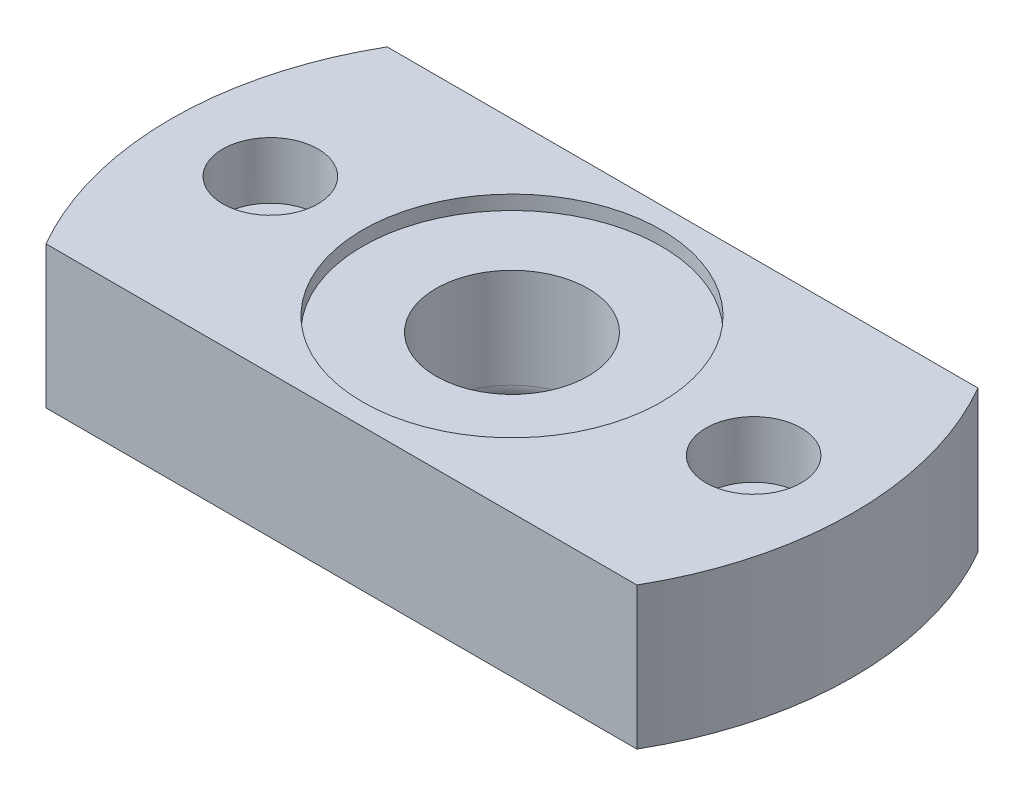
ISO-10303-21;
HEADER;
FILE_DESCRIPTION(('STEP AP214'),'2;1');
FILE_NAME('part.step','',(''),(''),'','','');
FILE_SCHEMA(('AUTOMOTIVE_DESIGN { 1 0 10303 214 1 1 1 1 }'));
ENDSEC;
DATA;
#1=APPLICATION_CONTEXT('core data for automotive mechanical design processes');
#2=APPLICATION_PROTOCOL_DEFINITION('international standard','automotive_design',2000,#1);
#3=PRODUCT_CONTEXT('',#1,'mechanical');
#4=PRODUCT('Part','Part','',(#3));
#5=PRODUCT_RELATED_PRODUCT_CATEGORY('part','',(#4));
#6=PRODUCT_DEFINITION_FORMATION('','',#4);
#7=PRODUCT_DEFINITION_CONTEXT('part definition',#1,'design');
#8=PRODUCT_DEFINITION('design','',#6,#7);
#9=PRODUCT_DEFINITION_SHAPE('','',#8);
#10=(LENGTH_UNIT() NAMED_UNIT(*) SI_UNIT(.MILLI.,.METRE.));
#11=(NAMED_UNIT(*) PLANE_ANGLE_UNIT() SI_UNIT($,.RADIAN.));
#12=(NAMED_UNIT(*) SI_UNIT($,.STERADIAN.) SOLID_ANGLE_UNIT());
#13=UNCERTAINTY_MEASURE_WITH_UNIT(LENGTH_MEASURE(1.E-05),#10,'distance_accuracy_value','');
#14=(GEOMETRIC_REPRESENTATION_CONTEXT(3) GLOBAL_UNCERTAINTY_ASSIGNED_CONTEXT((#13)) GLOBAL_UNIT_ASSIGNED_CONTEXT((#10,
#11,#12)) REPRESENTATION_CONTEXT('',''));
#15=CARTESIAN_POINT('',(0.,0.,0.));
#16=DIRECTION('',(0.,0.,1.));
#17=DIRECTION('',(1.,0.,0.));
#18=AXIS2_PLACEMENT_3D('',#15,#16,#17);
#19=CARTESIAN_POINT('',(-8.5,-1.,0.));
#20=DIRECTION('',(0.,1.,0.));
#21=DIRECTION('',(0.,0.,1.));
#22=AXIS2_PLACEMENT_3D('',#19,#20,#21);
#23=CYLINDRICAL_SURFACE('',#22,1.675);
#24=CARTESIAN_POINT('',(-8.5,5.,0.));
#25=DIRECTION('',(0.,1.,0.));
#26=DIRECTION('',(0.,0.,1.));
#27=AXIS2_PLACEMENT_3D('',#24,#25,#26);
#28=CIRCLE('',#27,1.675);
#29=CARTESIAN_POINT('',(-8.5,5.,1.675));
#30=VERTEX_POINT('',#29);
#31=EDGE_CURVE('E168',#30,#30,#28,.T.);
#32=ORIENTED_EDGE('',*,*,#31,.T.);
#33=EDGE_LOOP('',(#32));
#34=FACE_BOUND('',#33,.T.);
#35=CARTESIAN_POINT('',(-8.5,3.,0.));
#36=DIRECTION('',(0.,-1.,0.));
#37=DIRECTION('',(0.,0.,-1.));
#38=AXIS2_PLACEMENT_3D('',#35,#36,#37);
#39=CIRCLE('',#38,1.675);
#40=CARTESIAN_POINT('',(-8.5,3.,-1.675));
#41=VERTEX_POINT('',#40);
#42=EDGE_CURVE('E11',#41,#41,#39,.F.);
#43=ORIENTED_EDGE('',*,*,#42,.F.);
#44=EDGE_LOOP('',(#43));
#45=FACE_BOUND('',#44,.T.);
#46=ADVANCED_FACE('F31',(#34,#45),#23,.F.);
#47=CARTESIAN_POINT('',(8.5,-1.,0.));
#48=DIRECTION('',(0.,1.,0.));
#49=DIRECTION('',(0.,0.,1.));
#50=AXIS2_PLACEMENT_3D('',#47,#48,#49);
#51=CYLINDRICAL_SURFACE('',#50,1.675);
#52=CARTESIAN_POINT('',(8.5,5.,0.));
#53=DIRECTION('',(0.,1.,0.));
#54=DIRECTION('',(0.,0.,1.));
#55=AXIS2_PLACEMENT_3D('',#52,#53,#54);
#56=CIRCLE('',#55,1.675);
#57=CARTESIAN_POINT('',(8.5,5.,1.675));
#58=VERTEX_POINT('',#57);
#59=EDGE_CURVE('E320',#58,#58,#56,.T.);
#60=ORIENTED_EDGE('',*,*,#59,.T.);
#61=EDGE_LOOP('',(#60));
#62=FACE_BOUND('',#61,.T.);
#63=CARTESIAN_POINT('',(8.5,3.,0.));
#64=DIRECTION('',(0.,-1.,0.));
#65=DIRECTION('',(0.,0.,-1.));
#66=AXIS2_PLACEMENT_3D('',#63,#64,#65);
#67=CIRCLE('',#66,1.675);
#68=CARTESIAN_POINT('',(8.5,3.,-1.675));
#69=VERTEX_POINT('',#68);
#70=EDGE_CURVE('E39',#69,#69,#67,.F.);
#71=ORIENTED_EDGE('',*,*,#70,.F.);
#72=EDGE_LOOP('',(#71));
#73=FACE_BOUND('',#72,.T.);
#74=ADVANCED_FACE('F189',(#62,#73),#51,.F.);
#75=CARTESIAN_POINT('',(0.,5.,0.));
#76=DIRECTION('',(0.,-1.,0.));
#77=DIRECTION('',(0.,0.,-1.));
#78=AXIS2_PLACEMENT_3D('',#75,#76,#77);
#79=CYLINDRICAL_SURFACE('',#78,2.675);
#80=CARTESIAN_POINT('',(0.,1.,0.));
#81=DIRECTION('',(0.,1.,0.));
#82=DIRECTION('',(0.,0.,1.));
#83=AXIS2_PLACEMENT_3D('',#80,#81,#82);
#84=CIRCLE('',#83,2.675);
#85=CARTESIAN_POINT('',(0.,1.,2.675));
#86=VERTEX_POINT('',#85);
#87=EDGE_CURVE('E179',#86,#86,#84,.F.);
#88=ORIENTED_EDGE('',*,*,#87,.T.);
#89=EDGE_LOOP('',(#88));
#90=FACE_BOUND('',#89,.T.);
#91=CARTESIAN_POINT('',(0.,4.5,0.));
#92=DIRECTION('',(0.,1.,0.));
#93=DIRECTION('',(0.,0.,1.));
#94=AXIS2_PLACEMENT_3D('',#91,#92,#93);
#95=CIRCLE('',#94,2.675);
#96=CARTESIAN_POINT('',(0.,4.5,2.675));
#97=VERTEX_POINT('',#96);
#98=EDGE_CURVE('E161',#97,#97,#95,.T.);
#99=ORIENTED_EDGE('',*,*,#98,.T.);
#100=EDGE_LOOP('',(#99));
#101=FACE_BOUND('',#100,.T.);
#102=ADVANCED_FACE('F191',(#90,#101),#79,.F.);
#103=CARTESIAN_POINT('',(0.,5.,0.));
#104=DIRECTION('',(0.,-1.,0.));
#105=DIRECTION('',(0.,0.,-1.));
#106=AXIS2_PLACEMENT_3D('',#103,#104,#105);
#107=CYLINDRICAL_SURFACE('',#106,12.);
#108=CARTESIAN_POINT('',(0.,5.,0.));
#109=DIRECTION('',(0.,1.,0.));
#110=DIRECTION('',(0.,0.,1.));
#111=AXIS2_PLACEMENT_3D('',#108,#109,#110);
#112=CIRCLE('',#111,12.);
#113=CARTESIAN_POINT('',(-10.3923048454133,5.,-6.));
#114=VERTEX_POINT('',#113);
#115=CARTESIAN_POINT('',(-10.3923048454133,5.,6.));
#116=VERTEX_POINT('',#115);
#117=EDGE_CURVE('E53',#114,#116,#112,.T.);
#118=ORIENTED_EDGE('',*,*,#117,.F.);
#119=DIRECTION('',(0.,-1.,0.));
#120=VECTOR('',#119,1.);
#121=CARTESIAN_POINT('',(-10.3923048454133,5.,-6.));
#122=LINE('',#121,#120);
#123=CARTESIAN_POINT('',(-10.3923048454133,0.,-6.));
#124=VERTEX_POINT('',#123);
#125=EDGE_CURVE('E151',#114,#124,#122,.T.);
#126=ORIENTED_EDGE('',*,*,#125,.T.);
#127=CARTESIAN_POINT('',(0.,0.,0.));
#128=DIRECTION('',(0.,1.,0.));
#129=DIRECTION('',(0.,0.,1.));
#130=AXIS2_PLACEMENT_3D('',#127,#128,#129);
#131=CIRCLE('',#130,12.);
#132=CARTESIAN_POINT('',(-10.3923048454133,0.,6.));
#133=VERTEX_POINT('',#132);
#134=EDGE_CURVE('E160',#124,#133,#131,.T.);
#135=ORIENTED_EDGE('',*,*,#134,.T.);
#136=DIRECTION('',(0.,-1.,0.));
#137=VECTOR('',#136,1.);
#138=CARTESIAN_POINT('',(-10.3923048454133,5.,6.));
#139=LINE('',#138,#137);
#140=EDGE_CURVE('E171',#133,#116,#139,.F.);
#141=ORIENTED_EDGE('',*,*,#140,.T.);
#142=EDGE_LOOP('',(#118,#126,#135,#141));
#143=FACE_BOUND('',#142,.T.);
#144=ADVANCED_FACE('F198',(#143),#107,.T.);
#145=CARTESIAN_POINT('',(0.,5.,0.));
#146=DIRECTION('',(0.,1.,0.));
#147=DIRECTION('',(0.,0.,1.));
#148=AXIS2_PLACEMENT_3D('',#145,#146,#147);
#149=PLANE('',#148);
#150=CARTESIAN_POINT('',(0.,5.,0.));
#151=DIRECTION('',(0.,1.,0.));
#152=DIRECTION('',(0.,0.,1.));
#153=AXIS2_PLACEMENT_3D('',#150,#151,#152);
#154=CIRCLE('',#153,5.25);
#155=CARTESIAN_POINT('',(0.,5.,5.25));
#156=VERTEX_POINT('',#155);
#157=EDGE_CURVE('E607',#156,#156,#154,.T.);
#158=ORIENTED_EDGE('',*,*,#157,.F.);
#159=EDGE_LOOP('',(#158));
#160=FACE_BOUND('',#159,.T.);
#161=DIRECTION('',(1.,0.,0.));
#162=VECTOR('',#161,1.);
#163=CARTESIAN_POINT('',(0.,5.,-6.));
#164=LINE('',#163,#162);
#165=CARTESIAN_POINT('',(10.3923048454133,5.,-6.));
#166=VERTEX_POINT('',#165);
#167=EDGE_CURVE('E46',#114,#166,#164,.T.);
#168=ORIENTED_EDGE('',*,*,#167,.F.);
#169=ORIENTED_EDGE('',*,*,#117,.T.);
#170=DIRECTION('',(-1.,0.,0.));
#171=VECTOR('',#170,1.);
#172=CARTESIAN_POINT('',(0.,5.,6.));
#173=LINE('',#172,#171);
#174=CARTESIAN_POINT('',(10.3923048454133,5.,6.));
#175=VERTEX_POINT('',#174);
#176=EDGE_CURVE('E229',#175,#116,#173,.T.);
#177=ORIENTED_EDGE('',*,*,#176,.F.);
#178=EDGE_CURVE('E166',#175,#166,#112,.T.);
#179=ORIENTED_EDGE('',*,*,#178,.T.);
#180=EDGE_LOOP('',(#168,#169,#177,#179));
#181=FACE_BOUND('',#180,.T.);
#182=ORIENTED_EDGE('',*,*,#59,.F.);
#183=EDGE_LOOP('',(#182));
#184=FACE_BOUND('',#183,.T.);
#185=ORIENTED_EDGE('',*,*,#31,.F.);
#186=EDGE_LOOP('',(#185));
#187=FACE_BOUND('',#186,.T.);
#188=ADVANCED_FACE('F208',(#160,#181,#184,#187),#149,.T.);
#189=CARTESIAN_POINT('',(0.,0.,0.));
#190=DIRECTION('',(0.,1.,0.));
#191=DIRECTION('',(0.,0.,1.));
#192=AXIS2_PLACEMENT_3D('',#189,#190,#191);
#193=PLANE('',#192);
#194=CARTESIAN_POINT('',(0.,0.,0.));
#195=DIRECTION('',(0.,1.,0.));
#196=DIRECTION('',(0.,0.,1.));
#197=AXIS2_PLACEMENT_3D('',#194,#195,#196);
#198=CIRCLE('',#197,3.675);
#199=CARTESIAN_POINT('',(0.,0.,3.675));
#200=VERTEX_POINT('',#199);
#201=EDGE_CURVE('E176',#200,#200,#198,.T.);
#202=ORIENTED_EDGE('',*,*,#201,.T.);
#203=EDGE_LOOP('',(#202));
#204=FACE_BOUND('',#203,.T.);
#205=DIRECTION('',(-0.866025403784438,0.,-0.5));
#206=VECTOR('',#205,1.);
#207=CARTESIAN_POINT('',(5.575,0.,1.68874953737965));
#208=LINE('',#207,#206);
#209=CARTESIAN_POINT('',(8.5,0.,3.37749907475931));
#210=VERTEX_POINT('',#209);
#211=CARTESIAN_POINT('',(5.575,0.,1.68874953737965));
#212=VERTEX_POINT('',#211);
#213=EDGE_CURVE('E256',#210,#212,#208,.T.);
#214=ORIENTED_EDGE('',*,*,#213,.F.);
#215=DIRECTION('',(-0.866025403784439,0.,0.5));
#216=VECTOR('',#215,1.);
#217=CARTESIAN_POINT('',(8.5,0.,3.37749907475931));
#218=LINE('',#217,#216);
#219=CARTESIAN_POINT('',(11.425,0.,1.68874953737966));
#220=VERTEX_POINT('',#219);
#221=EDGE_CURVE('E231',#220,#210,#218,.T.);
#222=ORIENTED_EDGE('',*,*,#221,.F.);
#223=DIRECTION('',(0.,0.,1.));
#224=VECTOR('',#223,1.);
#225=CARTESIAN_POINT('',(11.425,0.,1.68874953737966));
#226=LINE('',#225,#224);
#227=CARTESIAN_POINT('',(11.425,0.,-1.68874953737966));
#228=VERTEX_POINT('',#227);
#229=EDGE_CURVE('E239',#228,#220,#226,.T.);
#230=ORIENTED_EDGE('',*,*,#229,.F.);
#231=DIRECTION('',(0.866025403784439,0.,0.5));
#232=VECTOR('',#231,1.);
#233=CARTESIAN_POINT('',(11.425,0.,-1.68874953737966));
#234=LINE('',#233,#232);
#235=CARTESIAN_POINT('',(8.5,0.,-3.37749907475931));
#236=VERTEX_POINT('',#235);
#237=EDGE_CURVE('E265',#236,#228,#234,.T.);
#238=ORIENTED_EDGE('',*,*,#237,.F.);
#239=DIRECTION('',(0.866025403784439,0.,-0.5));
#240=VECTOR('',#239,1.);
#241=CARTESIAN_POINT('',(8.5,0.,-3.37749907475931));
#242=LINE('',#241,#240);
#243=CARTESIAN_POINT('',(5.575,0.,-1.68874953737966));
#244=VERTEX_POINT('',#243);
#245=EDGE_CURVE('E262',#244,#236,#242,.T.);
#246=ORIENTED_EDGE('',*,*,#245,.F.);
#247=DIRECTION('',(0.,0.,-1.));
#248=VECTOR('',#247,1.);
#249=CARTESIAN_POINT('',(5.575,0.,-1.68874953737966));
#250=LINE('',#249,#248);
#251=EDGE_CURVE('E259',#212,#244,#250,.T.);
#252=ORIENTED_EDGE('',*,*,#251,.F.);
#253=EDGE_LOOP('',(#214,#222,#230,#238,#246,#252));
#254=FACE_BOUND('',#253,.T.);
#255=DIRECTION('',(0.866025403784439,0.,-0.5));
#256=VECTOR('',#255,1.);
#257=CARTESIAN_POINT('',(-11.425,0.,-1.68874953737966));
#258=LINE('',#257,#256);
#259=CARTESIAN_POINT('',(-11.425,0.,-1.68874953737965));
#260=VERTEX_POINT('',#259);
#261=CARTESIAN_POINT('',(-8.5,0.,-3.37749907475931));
#262=VERTEX_POINT('',#261);
#263=EDGE_CURVE('E304',#260,#262,#258,.T.);
#264=ORIENTED_EDGE('',*,*,#263,.F.);
#265=DIRECTION('',(0.,0.,-1.));
#266=VECTOR('',#265,1.);
#267=CARTESIAN_POINT('',(-11.425,0.,1.68874953737966));
#268=LINE('',#267,#266);
#269=CARTESIAN_POINT('',(-11.425,0.,1.68874953737966));
#270=VERTEX_POINT('',#269);
#271=EDGE_CURVE('E272',#270,#260,#268,.T.);
#272=ORIENTED_EDGE('',*,*,#271,.F.);
#273=DIRECTION('',(-0.866025403784439,0.,-0.5));
#274=VECTOR('',#273,1.);
#275=CARTESIAN_POINT('',(-8.5,0.,3.37749907475931));
#276=LINE('',#275,#274);
#277=CARTESIAN_POINT('',(-8.5,0.,3.37749907475931));
#278=VERTEX_POINT('',#277);
#279=EDGE_CURVE('E287',#278,#270,#276,.T.);
#280=ORIENTED_EDGE('',*,*,#279,.F.);
#281=DIRECTION('',(-0.866025403784438,0.,0.5));
#282=VECTOR('',#281,1.);
#283=CARTESIAN_POINT('',(-5.575,0.,1.68874953737965));
#284=LINE('',#283,#282);
#285=CARTESIAN_POINT('',(-5.575,0.,1.68874953737965));
#286=VERTEX_POINT('',#285);
#287=EDGE_CURVE('E313',#286,#278,#284,.T.);
#288=ORIENTED_EDGE('',*,*,#287,.F.);
#289=DIRECTION('',(0.,0.,1.));
#290=VECTOR('',#289,1.);
#291=CARTESIAN_POINT('',(-5.575,0.,-1.68874953737966));
#292=LINE('',#291,#290);
#293=CARTESIAN_POINT('',(-5.575,0.,-1.68874953737966));
#294=VERTEX_POINT('',#293);
#295=EDGE_CURVE('E310',#294,#286,#292,.T.);
#296=ORIENTED_EDGE('',*,*,#295,.F.);
#297=DIRECTION('',(0.866025403784439,0.,0.5));
#298=VECTOR('',#297,1.);
#299=CARTESIAN_POINT('',(-8.5,0.,-3.37749907475931));
#300=LINE('',#299,#298);
#301=EDGE_CURVE('E307',#262,#294,#300,.T.);
#302=ORIENTED_EDGE('',*,*,#301,.F.);
#303=EDGE_LOOP('',(#264,#272,#280,#288,#296,#302));
#304=FACE_BOUND('',#303,.T.);
#305=ORIENTED_EDGE('',*,*,#134,.F.);
#306=DIRECTION('',(-1.,0.,0.));
#307=VECTOR('',#306,1.);
#308=CARTESIAN_POINT('',(-10.3923048454133,0.,-6.));
#309=LINE('',#308,#307);
#310=CARTESIAN_POINT('',(10.3923048454133,0.,-6.));
#311=VERTEX_POINT('',#310);
#312=EDGE_CURVE('E145',#311,#124,#309,.T.);
#313=ORIENTED_EDGE('',*,*,#312,.F.);
#314=CARTESIAN_POINT('',(10.3923048454133,0.,6.));
#315=VERTEX_POINT('',#314);
#316=EDGE_CURVE('E159',#315,#311,#131,.T.);
#317=ORIENTED_EDGE('',*,*,#316,.F.);
#318=DIRECTION('',(1.,0.,0.));
#319=VECTOR('',#318,1.);
#320=CARTESIAN_POINT('',(-10.3923048454133,0.,6.));
#321=LINE('',#320,#319);
#322=EDGE_CURVE('E228',#133,#315,#321,.T.);
#323=ORIENTED_EDGE('',*,*,#322,.F.);
#324=EDGE_LOOP('',(#305,#313,#317,#323));
#325=FACE_BOUND('',#324,.T.);
#326=ADVANCED_FACE('F157',(#204,#254,#304,#325),#193,.F.);
#327=ORIENTED_EDGE('',*,*,#316,.T.);
#328=DIRECTION('',(0.,-1.,0.));
#329=VECTOR('',#328,1.);
#330=CARTESIAN_POINT('',(10.3923048454133,5.,-6.));
#331=LINE('',#330,#329);
#332=EDGE_CURVE('E142',#311,#166,#331,.F.);
#333=ORIENTED_EDGE('',*,*,#332,.T.);
#334=ORIENTED_EDGE('',*,*,#178,.F.);
#335=DIRECTION('',(0.,-1.,0.));
#336=VECTOR('',#335,1.);
#337=CARTESIAN_POINT('',(10.3923048454133,5.,6.));
#338=LINE('',#337,#336);
#339=EDGE_CURVE('E152',#175,#315,#338,.T.);
#340=ORIENTED_EDGE('',*,*,#339,.T.);
#341=EDGE_LOOP('',(#327,#333,#334,#340));
#342=FACE_BOUND('',#341,.T.);
#343=ADVANCED_FACE('F164',(#342),#107,.T.);
#344=CARTESIAN_POINT('',(-11.425,2.5,-1.68874953737966));
#345=DIRECTION('',(0.,-1.,0.));
#346=DIRECTION('',(0.,0.,-1.));
#347=AXIS2_PLACEMENT_3D('',#344,#345,#346);
#348=PLANE('',#347);
#349=DIRECTION('',(0.,0.,-1.));
#350=VECTOR('',#349,1.);
#351=CARTESIAN_POINT('',(-11.425,2.5,1.68874953737966));
#352=LINE('',#351,#350);
#353=CARTESIAN_POINT('',(-11.425,2.5,1.68874953737966));
#354=VERTEX_POINT('',#353);
#355=CARTESIAN_POINT('',(-11.425,2.5,-1.68874953737966));
#356=VERTEX_POINT('',#355);
#357=EDGE_CURVE('E283',#354,#356,#352,.T.);
#358=ORIENTED_EDGE('',*,*,#357,.T.);
#359=DIRECTION('',(0.866025403784439,0.,-0.5));
#360=VECTOR('',#359,1.);
#361=CARTESIAN_POINT('',(-11.425,2.5,-1.68874953737966));
#362=LINE('',#361,#360);
#363=CARTESIAN_POINT('',(-8.5,2.5,-3.37749907475931));
#364=VERTEX_POINT('',#363);
#365=EDGE_CURVE('E286',#356,#364,#362,.T.);
#366=ORIENTED_EDGE('',*,*,#365,.T.);
#367=DIRECTION('',(0.866025403784439,0.,0.5));
#368=VECTOR('',#367,1.);
#369=CARTESIAN_POINT('',(-8.5,2.5,-3.37749907475931));
#370=LINE('',#369,#368);
#371=CARTESIAN_POINT('',(-5.575,2.5,-1.68874953737966));
#372=VERTEX_POINT('',#371);
#373=EDGE_CURVE('E290',#364,#372,#370,.T.);
#374=ORIENTED_EDGE('',*,*,#373,.T.);
#375=DIRECTION('',(0.,0.,1.));
#376=VECTOR('',#375,1.);
#377=CARTESIAN_POINT('',(-5.575,2.5,-1.68874953737966));
#378=LINE('',#377,#376);
#379=CARTESIAN_POINT('',(-5.575,2.5,1.68874953737965));
#380=VERTEX_POINT('',#379);
#381=EDGE_CURVE('E293',#372,#380,#378,.T.);
#382=ORIENTED_EDGE('',*,*,#381,.T.);
#383=DIRECTION('',(-0.866025403784438,0.,0.5));
#384=VECTOR('',#383,1.);
#385=CARTESIAN_POINT('',(-5.575,2.5,1.68874953737965));
#386=LINE('',#385,#384);
#387=CARTESIAN_POINT('',(-8.5,2.5,3.37749907475931));
#388=VERTEX_POINT('',#387);
#389=EDGE_CURVE('E296',#380,#388,#386,.T.);
#390=ORIENTED_EDGE('',*,*,#389,.T.);
#391=DIRECTION('',(-0.866025403784439,0.,-0.5));
#392=VECTOR('',#391,1.);
#393=CARTESIAN_POINT('',(-8.5,2.5,3.37749907475931));
#394=LINE('',#393,#392);
#395=EDGE_CURVE('E299',#388,#354,#394,.T.);
#396=ORIENTED_EDGE('',*,*,#395,.T.);
#397=EDGE_LOOP('',(#358,#366,#374,#382,#390,#396));
#398=FACE_BOUND('',#397,.T.);
#399=ADVANCED_FACE('F215',(#398),#348,.T.);
#400=CARTESIAN_POINT('',(-11.425,2.5,1.68874953737966));
#401=DIRECTION('',(-1.,0.,0.));
#402=DIRECTION('',(0.,0.,1.));
#403=AXIS2_PLACEMENT_3D('',#400,#401,#402);
#404=PLANE('',#403);
#405=ORIENTED_EDGE('',*,*,#271,.T.);
#406=DIRECTION('',(0.,-1.,0.));
#407=VECTOR('',#406,1.);
#408=CARTESIAN_POINT('',(-11.425,2.5,-1.68874953737966));
#409=LINE('',#408,#407);
#410=EDGE_CURVE('E302',#356,#260,#409,.T.);
#411=ORIENTED_EDGE('',*,*,#410,.F.);
#412=ORIENTED_EDGE('',*,*,#357,.F.);
#413=DIRECTION('',(0.,-1.,0.));
#414=VECTOR('',#413,1.);
#415=CARTESIAN_POINT('',(-11.425,2.5,1.68874953737966));
#416=LINE('',#415,#414);
#417=EDGE_CURVE('E318',#354,#270,#416,.T.);
#418=ORIENTED_EDGE('',*,*,#417,.T.);
#419=EDGE_LOOP('',(#405,#411,#412,#418));
#420=FACE_BOUND('',#419,.T.);
#421=ADVANCED_FACE('F205',(#420),#404,.F.);
#422=CARTESIAN_POINT('',(-8.5,2.5,3.37749907475931));
#423=DIRECTION('',(-0.5,0.,0.866025403784439));
#424=DIRECTION('',(0.866025403784439,0.,0.5));
#425=AXIS2_PLACEMENT_3D('',#422,#423,#424);
#426=PLANE('',#425);
#427=ORIENTED_EDGE('',*,*,#279,.T.);
#428=ORIENTED_EDGE('',*,*,#417,.F.);
#429=ORIENTED_EDGE('',*,*,#395,.F.);
#430=DIRECTION('',(0.,-1.,0.));
#431=VECTOR('',#430,1.);
#432=CARTESIAN_POINT('',(-8.5,2.5,3.37749907475931));
#433=LINE('',#432,#431);
#434=EDGE_CURVE('E321',#388,#278,#433,.T.);
#435=ORIENTED_EDGE('',*,*,#434,.T.);
#436=EDGE_LOOP('',(#427,#428,#429,#435));
#437=FACE_BOUND('',#436,.T.);
#438=ADVANCED_FACE('F386',(#437),#426,.F.);
#439=CARTESIAN_POINT('',(-5.575,2.5,1.68874953737965));
#440=DIRECTION('',(0.5,0.,0.866025403784439));
#441=DIRECTION('',(0.866025403784439,0.,-0.5));
#442=AXIS2_PLACEMENT_3D('',#439,#440,#441);
#443=PLANE('',#442);
#444=ORIENTED_EDGE('',*,*,#287,.T.);
#445=ORIENTED_EDGE('',*,*,#434,.F.);
#446=ORIENTED_EDGE('',*,*,#389,.F.);
#447=DIRECTION('',(0.,-1.,0.));
#448=VECTOR('',#447,1.);
#449=CARTESIAN_POINT('',(-5.575,2.5,1.68874953737965));
#450=LINE('',#449,#448);
#451=EDGE_CURVE('E323',#380,#286,#450,.T.);
#452=ORIENTED_EDGE('',*,*,#451,.T.);
#453=EDGE_LOOP('',(#444,#445,#446,#452));
#454=FACE_BOUND('',#453,.T.);
#455=ADVANCED_FACE('F389',(#454),#443,.F.);
#456=CARTESIAN_POINT('',(-5.575,2.5,-1.68874953737966));
#457=DIRECTION('',(1.,0.,0.));
#458=DIRECTION('',(0.,0.,-1.));
#459=AXIS2_PLACEMENT_3D('',#456,#457,#458);
#460=PLANE('',#459);
#461=ORIENTED_EDGE('',*,*,#295,.T.);
#462=ORIENTED_EDGE('',*,*,#451,.F.);
#463=ORIENTED_EDGE('',*,*,#381,.F.);
#464=DIRECTION('',(0.,-1.,0.));
#465=VECTOR('',#464,1.);
#466=CARTESIAN_POINT('',(-5.575,2.5,-1.68874953737966));
#467=LINE('',#466,#465);
#468=EDGE_CURVE('E325',#372,#294,#467,.T.);
#469=ORIENTED_EDGE('',*,*,#468,.T.);
#470=EDGE_LOOP('',(#461,#462,#463,#469));
#471=FACE_BOUND('',#470,.T.);
#472=ADVANCED_FACE('F393',(#471),#460,.F.);
#473=CARTESIAN_POINT('',(-8.5,2.5,-3.37749907475931));
#474=DIRECTION('',(0.5,0.,-0.866025403784439));
#475=DIRECTION('',(-0.866025403784439,0.,-0.5));
#476=AXIS2_PLACEMENT_3D('',#473,#474,#475);
#477=PLANE('',#476);
#478=ORIENTED_EDGE('',*,*,#301,.T.);
#479=ORIENTED_EDGE('',*,*,#468,.F.);
#480=ORIENTED_EDGE('',*,*,#373,.F.);
#481=DIRECTION('',(0.,-1.,0.));
#482=VECTOR('',#481,1.);
#483=CARTESIAN_POINT('',(-8.5,2.5,-3.37749907475931));
#484=LINE('',#483,#482);
#485=EDGE_CURVE('E327',#364,#262,#484,.T.);
#486=ORIENTED_EDGE('',*,*,#485,.T.);
#487=EDGE_LOOP('',(#478,#479,#480,#486));
#488=FACE_BOUND('',#487,.T.);
#489=ADVANCED_FACE('F397',(#488),#477,.F.);
#490=CARTESIAN_POINT('',(-11.425,2.5,-1.68874953737966));
#491=DIRECTION('',(-0.5,0.,-0.866025403784439));
#492=DIRECTION('',(-0.866025403784439,0.,0.5));
#493=AXIS2_PLACEMENT_3D('',#490,#491,#492);
#494=PLANE('',#493);
#495=ORIENTED_EDGE('',*,*,#263,.T.);
#496=ORIENTED_EDGE('',*,*,#485,.F.);
#497=ORIENTED_EDGE('',*,*,#365,.F.);
#498=ORIENTED_EDGE('',*,*,#410,.T.);
#499=EDGE_LOOP('',(#495,#496,#497,#498));
#500=FACE_BOUND('',#499,.T.);
#501=ADVANCED_FACE('F362',(#500),#494,.F.);
#502=CARTESIAN_POINT('',(11.425,2.5,1.68874953737966));
#503=DIRECTION('',(0.,1.,0.));
#504=DIRECTION('',(0.,0.,1.));
#505=AXIS2_PLACEMENT_3D('',#502,#503,#504);
#506=PLANE('',#505);
#507=DIRECTION('',(-0.866025403784439,0.,0.5));
#508=VECTOR('',#507,1.);
#509=CARTESIAN_POINT('',(8.5,2.5,3.37749907475931));
#510=LINE('',#509,#508);
#511=CARTESIAN_POINT('',(11.425,2.5,1.68874953737966));
#512=VERTEX_POINT('',#511);
#513=CARTESIAN_POINT('',(8.5,2.5,3.37749907475931));
#514=VERTEX_POINT('',#513);
#515=EDGE_CURVE('E235',#512,#514,#510,.T.);
#516=ORIENTED_EDGE('',*,*,#515,.T.);
#517=DIRECTION('',(-0.866025403784438,0.,-0.5));
#518=VECTOR('',#517,1.);
#519=CARTESIAN_POINT('',(5.575,2.5,1.68874953737965));
#520=LINE('',#519,#518);
#521=CARTESIAN_POINT('',(5.575,2.5,1.68874953737965));
#522=VERTEX_POINT('',#521);
#523=EDGE_CURVE('E238',#514,#522,#520,.T.);
#524=ORIENTED_EDGE('',*,*,#523,.T.);
#525=DIRECTION('',(0.,0.,-1.));
#526=VECTOR('',#525,1.);
#527=CARTESIAN_POINT('',(5.575,2.5,-1.68874953737966));
#528=LINE('',#527,#526);
#529=CARTESIAN_POINT('',(5.575,2.5,-1.68874953737966));
#530=VERTEX_POINT('',#529);
#531=EDGE_CURVE('E242',#522,#530,#528,.T.);
#532=ORIENTED_EDGE('',*,*,#531,.T.);
#533=DIRECTION('',(0.866025403784439,0.,-0.5));
#534=VECTOR('',#533,1.);
#535=CARTESIAN_POINT('',(8.5,2.5,-3.37749907475931));
#536=LINE('',#535,#534);
#537=CARTESIAN_POINT('',(8.5,2.5,-3.37749907475931));
#538=VERTEX_POINT('',#537);
#539=EDGE_CURVE('E245',#530,#538,#536,.T.);
#540=ORIENTED_EDGE('',*,*,#539,.T.);
#541=DIRECTION('',(0.866025403784439,0.,0.5));
#542=VECTOR('',#541,1.);
#543=CARTESIAN_POINT('',(11.425,2.5,-1.68874953737966));
#544=LINE('',#543,#542);
#545=CARTESIAN_POINT('',(11.425,2.5,-1.68874953737966));
#546=VERTEX_POINT('',#545);
#547=EDGE_CURVE('E248',#538,#546,#544,.T.);
#548=ORIENTED_EDGE('',*,*,#547,.T.);
#549=DIRECTION('',(0.,0.,1.));
#550=VECTOR('',#549,1.);
#551=CARTESIAN_POINT('',(11.425,2.5,1.68874953737966));
#552=LINE('',#551,#550);
#553=EDGE_CURVE('E251',#546,#512,#552,.T.);
#554=ORIENTED_EDGE('',*,*,#553,.T.);
#555=EDGE_LOOP('',(#516,#524,#532,#540,#548,#554));
#556=FACE_BOUND('',#555,.T.);
#557=ADVANCED_FACE('F358',(#556),#506,.F.);
#558=CARTESIAN_POINT('',(8.5,2.5,3.37749907475931));
#559=DIRECTION('',(0.5,0.,0.866025403784439));
#560=DIRECTION('',(0.866025403784439,0.,-0.5));
#561=AXIS2_PLACEMENT_3D('',#558,#559,#560);
#562=PLANE('',#561);
#563=ORIENTED_EDGE('',*,*,#221,.T.);
#564=DIRECTION('',(0.,-1.,0.));
#565=VECTOR('',#564,1.);
#566=CARTESIAN_POINT('',(8.5,2.5,3.37749907475931));
#567=LINE('',#566,#565);
#568=EDGE_CURVE('E254',#514,#210,#567,.T.);
#569=ORIENTED_EDGE('',*,*,#568,.F.);
#570=ORIENTED_EDGE('',*,*,#515,.F.);
#571=DIRECTION('',(0.,-1.,0.));
#572=VECTOR('',#571,1.);
#573=CARTESIAN_POINT('',(11.425,2.5,1.68874953737966));
#574=LINE('',#573,#572);
#575=EDGE_CURVE('E270',#512,#220,#574,.T.);
#576=ORIENTED_EDGE('',*,*,#575,.T.);
#577=EDGE_LOOP('',(#563,#569,#570,#576));
#578=FACE_BOUND('',#577,.T.);
#579=ADVANCED_FACE('F361',(#578),#562,.F.);
#580=CARTESIAN_POINT('',(11.425,2.5,1.68874953737966));
#581=DIRECTION('',(1.,0.,0.));
#582=DIRECTION('',(0.,0.,-1.));
#583=AXIS2_PLACEMENT_3D('',#580,#581,#582);
#584=PLANE('',#583);
#585=ORIENTED_EDGE('',*,*,#229,.T.);
#586=ORIENTED_EDGE('',*,*,#575,.F.);
#587=ORIENTED_EDGE('',*,*,#553,.F.);
#588=DIRECTION('',(0.,-1.,0.));
#589=VECTOR('',#588,1.);
#590=CARTESIAN_POINT('',(11.425,2.5,-1.68874953737966));
#591=LINE('',#590,#589);
#592=EDGE_CURVE('E273',#546,#228,#591,.T.);
#593=ORIENTED_EDGE('',*,*,#592,.T.);
#594=EDGE_LOOP('',(#585,#586,#587,#593));
#595=FACE_BOUND('',#594,.T.);
#596=ADVANCED_FACE('F364',(#595),#584,.F.);
#597=CARTESIAN_POINT('',(11.425,2.5,-1.68874953737966));
#598=DIRECTION('',(0.5,0.,-0.866025403784439));
#599=DIRECTION('',(-0.866025403784439,0.,-0.5));
#600=AXIS2_PLACEMENT_3D('',#597,#598,#599);
#601=PLANE('',#600);
#602=ORIENTED_EDGE('',*,*,#237,.T.);
#603=ORIENTED_EDGE('',*,*,#592,.F.);
#604=ORIENTED_EDGE('',*,*,#547,.F.);
#605=DIRECTION('',(0.,-1.,0.));
#606=VECTOR('',#605,1.);
#607=CARTESIAN_POINT('',(8.5,2.5,-3.37749907475931));
#608=LINE('',#607,#606);
#609=EDGE_CURVE('E275',#538,#236,#608,.T.);
#610=ORIENTED_EDGE('',*,*,#609,.T.);
#611=EDGE_LOOP('',(#602,#603,#604,#610));
#612=FACE_BOUND('',#611,.T.);
#613=ADVANCED_FACE('F367',(#612),#601,.F.);
#614=CARTESIAN_POINT('',(8.5,2.5,-3.37749907475931));
#615=DIRECTION('',(-0.5,0.,-0.866025403784439));
#616=DIRECTION('',(-0.866025403784439,0.,0.5));
#617=AXIS2_PLACEMENT_3D('',#614,#615,#616);
#618=PLANE('',#617);
#619=ORIENTED_EDGE('',*,*,#245,.T.);
#620=ORIENTED_EDGE('',*,*,#609,.F.);
#621=ORIENTED_EDGE('',*,*,#539,.F.);
#622=DIRECTION('',(0.,-1.,0.));
#623=VECTOR('',#622,1.);
#624=CARTESIAN_POINT('',(5.575,2.5,-1.68874953737966));
#625=LINE('',#624,#623);
#626=EDGE_CURVE('E277',#530,#244,#625,.T.);
#627=ORIENTED_EDGE('',*,*,#626,.T.);
#628=EDGE_LOOP('',(#619,#620,#621,#627));
#629=FACE_BOUND('',#628,.T.);
#630=ADVANCED_FACE('F371',(#629),#618,.F.);
#631=CARTESIAN_POINT('',(5.575,2.5,-1.68874953737966));
#632=DIRECTION('',(-1.,0.,0.));
#633=DIRECTION('',(0.,0.,1.));
#634=AXIS2_PLACEMENT_3D('',#631,#632,#633);
#635=PLANE('',#634);
#636=ORIENTED_EDGE('',*,*,#251,.T.);
#637=ORIENTED_EDGE('',*,*,#626,.F.);
#638=ORIENTED_EDGE('',*,*,#531,.F.);
#639=DIRECTION('',(0.,-1.,0.));
#640=VECTOR('',#639,1.);
#641=CARTESIAN_POINT('',(5.575,2.5,1.68874953737965));
#642=LINE('',#641,#640);
#643=EDGE_CURVE('E279',#522,#212,#642,.T.);
#644=ORIENTED_EDGE('',*,*,#643,.T.);
#645=EDGE_LOOP('',(#636,#637,#638,#644));
#646=FACE_BOUND('',#645,.T.);
#647=ADVANCED_FACE('F375',(#646),#635,.F.);
#648=CARTESIAN_POINT('',(5.575,2.5,1.68874953737965));
#649=DIRECTION('',(-0.5,0.,0.866025403784439));
#650=DIRECTION('',(0.866025403784439,0.,0.5));
#651=AXIS2_PLACEMENT_3D('',#648,#649,#650);
#652=PLANE('',#651);
#653=ORIENTED_EDGE('',*,*,#213,.T.);
#654=ORIENTED_EDGE('',*,*,#643,.F.);
#655=ORIENTED_EDGE('',*,*,#523,.F.);
#656=ORIENTED_EDGE('',*,*,#568,.T.);
#657=EDGE_LOOP('',(#653,#654,#655,#656));
#658=FACE_BOUND('',#657,.T.);
#659=ADVANCED_FACE('F357',(#658),#652,.F.);
#660=CARTESIAN_POINT('',(-10.3923048454133,10.,6.));
#661=DIRECTION('',(0.,0.,-1.));
#662=DIRECTION('',(-1.,0.,0.));
#663=AXIS2_PLACEMENT_3D('',#660,#661,#662);
#664=PLANE('',#663);
#665=ORIENTED_EDGE('',*,*,#176,.T.);
#666=ORIENTED_EDGE('',*,*,#140,.F.);
#667=ORIENTED_EDGE('',*,*,#322,.T.);
#668=ORIENTED_EDGE('',*,*,#339,.F.);
#669=EDGE_LOOP('',(#665,#666,#667,#668));
#670=FACE_BOUND('',#669,.T.);
#671=ADVANCED_FACE('F227',(#670),#664,.F.);
#672=CARTESIAN_POINT('',(-10.3923048454133,10.,-6.));
#673=DIRECTION('',(0.,0.,1.));
#674=DIRECTION('',(1.,0.,0.));
#675=AXIS2_PLACEMENT_3D('',#672,#673,#674);
#676=PLANE('',#675);
#677=ORIENTED_EDGE('',*,*,#167,.T.);
#678=ORIENTED_EDGE('',*,*,#332,.F.);
#679=ORIENTED_EDGE('',*,*,#312,.T.);
#680=ORIENTED_EDGE('',*,*,#125,.F.);
#681=EDGE_LOOP('',(#677,#678,#679,#680));
#682=FACE_BOUND('',#681,.T.);
#683=ADVANCED_FACE('F144',(#682),#676,.F.);
#684=CARTESIAN_POINT('',(0.,1.,0.));
#685=DIRECTION('',(0.,1.,0.));
#686=DIRECTION('',(0.,0.,1.));
#687=AXIS2_PLACEMENT_3D('',#684,#685,#686);
#688=TOROIDAL_SURFACE('',#687,3.675,1.);
#689=ORIENTED_EDGE('',*,*,#87,.F.);
#690=EDGE_LOOP('',(#689));
#691=FACE_BOUND('',#690,.T.);
#692=ORIENTED_EDGE('',*,*,#201,.F.);
#693=EDGE_LOOP('',(#692));
#694=FACE_BOUND('',#693,.T.);
#695=ADVANCED_FACE('F33',(#691,#694),#688,.T.);
#696=CARTESIAN_POINT('',(0.,4.5,0.));
#697=DIRECTION('',(0.,1.,0.));
#698=DIRECTION('',(0.,0.,1.));
#699=AXIS2_PLACEMENT_3D('',#696,#697,#698);
#700=CYLINDRICAL_SURFACE('',#699,5.25);
#701=CARTESIAN_POINT('',(0.,4.5,0.));
#702=DIRECTION('',(0.,1.,0.));
#703=DIRECTION('',(0.,0.,1.));
#704=AXIS2_PLACEMENT_3D('',#701,#702,#703);
#705=CIRCLE('',#704,5.25);
#706=CARTESIAN_POINT('',(0.,4.5,5.25));
#707=VERTEX_POINT('',#706);
#708=EDGE_CURVE('E183',#707,#707,#705,.T.);
#709=ORIENTED_EDGE('',*,*,#708,.F.);
#710=EDGE_LOOP('',(#709));
#711=FACE_BOUND('',#710,.T.);
#712=ORIENTED_EDGE('',*,*,#157,.T.);
#713=EDGE_LOOP('',(#712));
#714=FACE_BOUND('',#713,.T.);
#715=ADVANCED_FACE('F348',(#711,#714),#700,.F.);
#716=CARTESIAN_POINT('',(0.,4.5,0.));
#717=DIRECTION('',(0.,1.,0.));
#718=DIRECTION('',(0.,0.,1.));
#719=AXIS2_PLACEMENT_3D('',#716,#717,#718);
#720=PLANE('',#719);
#721=ORIENTED_EDGE('',*,*,#98,.F.);
#722=EDGE_LOOP('',(#721));
#723=FACE_BOUND('',#722,.T.);
#724=ORIENTED_EDGE('',*,*,#708,.T.);
#725=EDGE_LOOP('',(#724));
#726=FACE_BOUND('',#725,.T.);
#727=ADVANCED_FACE('F343',(#723,#726),#720,.T.);
#728=CARTESIAN_POINT('',(8.5,3.,0.));
#729=DIRECTION('',(0.,-1.,0.));
#730=DIRECTION('',(0.,0.,-1.));
#731=AXIS2_PLACEMENT_3D('',#728,#729,#730);
#732=PLANE('',#731);
#733=ORIENTED_EDGE('',*,*,#70,.T.);
#734=EDGE_LOOP('',(#733));
#735=FACE_BOUND('',#734,.T.);
#736=ADVANCED_FACE('F187',(#735),#732,.F.);
#737=CARTESIAN_POINT('',(-8.5,3.,0.));
#738=DIRECTION('',(0.,-1.,0.));
#739=DIRECTION('',(0.,0.,-1.));
#740=AXIS2_PLACEMENT_3D('',#737,#738,#739);
#741=PLANE('',#740);
#742=ORIENTED_EDGE('',*,*,#42,.T.);
#743=EDGE_LOOP('',(#742));
#744=FACE_BOUND('',#743,.T.);
#745=ADVANCED_FACE('F337',(#744),#741,.F.);
#746=CLOSED_SHELL('',(#46,#74,#102,#144,#188,#326,#343,#399,#421,#438,#455,#472,#489,#501,#557,
#579,#596,#613,#630,#647,#659,#671,#683,#695,#715,#727,#736,#745));
#747=MANIFOLD_SOLID_BREP('B2',#746);
#748=ADVANCED_BREP_SHAPE_REPRESENTATION('',(#18,#747),#14);
#749=SHAPE_DEFINITION_REPRESENTATION(#9,#748);
ENDSEC;
END-ISO-10303-21;
